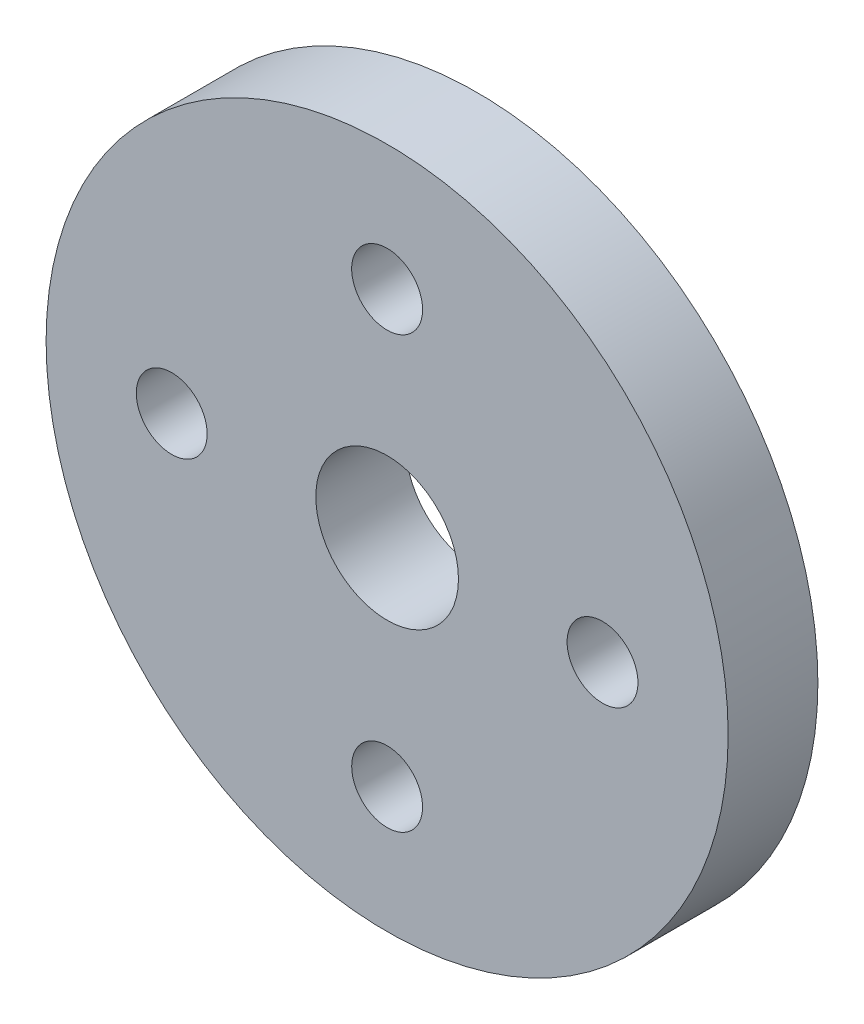
ISO-10303-21;
HEADER;
FILE_DESCRIPTION(('STEP AP214'),'2;1');
FILE_NAME('part.step','',(''),(''),'','','');
FILE_SCHEMA(('AUTOMOTIVE_DESIGN { 1 0 10303 214 1 1 1 1 }'));
ENDSEC;
DATA;
#1=APPLICATION_CONTEXT('core data for automotive mechanical design processes');
#2=APPLICATION_PROTOCOL_DEFINITION('international standard','automotive_design',2000,#1);
#3=PRODUCT_CONTEXT('',#1,'mechanical');
#4=PRODUCT('Part','Part','',(#3));
#5=PRODUCT_RELATED_PRODUCT_CATEGORY('part','',(#4));
#6=PRODUCT_DEFINITION_FORMATION('','',#4);
#7=PRODUCT_DEFINITION_CONTEXT('part definition',#1,'design');
#8=PRODUCT_DEFINITION('design','',#6,#7);
#9=PRODUCT_DEFINITION_SHAPE('','',#8);
#10=(LENGTH_UNIT() NAMED_UNIT(*) SI_UNIT(.MILLI.,.METRE.));
#11=(NAMED_UNIT(*) PLANE_ANGLE_UNIT() SI_UNIT($,.RADIAN.));
#12=(NAMED_UNIT(*) SI_UNIT($,.STERADIAN.) SOLID_ANGLE_UNIT());
#13=UNCERTAINTY_MEASURE_WITH_UNIT(LENGTH_MEASURE(1.E-05),#10,'distance_accuracy_value','');
#14=(GEOMETRIC_REPRESENTATION_CONTEXT(3) GLOBAL_UNCERTAINTY_ASSIGNED_CONTEXT((#13)) GLOBAL_UNIT_ASSIGNED_CONTEXT((#10,
#11,#12)) REPRESENTATION_CONTEXT('',''));
#15=CARTESIAN_POINT('',(0.,0.,0.));
#16=DIRECTION('',(0.,0.,1.));
#17=DIRECTION('',(1.,0.,0.));
#18=AXIS2_PLACEMENT_3D('',#15,#16,#17);
#19=CARTESIAN_POINT('',(0.,0.,5.));
#20=DIRECTION('',(0.,0.,1.));
#21=DIRECTION('',(1.,0.,0.));
#22=AXIS2_PLACEMENT_3D('',#19,#20,#21);
#23=PLANE('',#22);
#24=CARTESIAN_POINT('',(-12.,0.,5.));
#25=DIRECTION('',(0.,0.,1.));
#26=DIRECTION('',(-1.,0.,0.));
#27=AXIS2_PLACEMENT_3D('',#24,#25,#26);
#28=CIRCLE('',#27,1.975);
#29=CARTESIAN_POINT('',(-13.975,0.,5.));
#30=VERTEX_POINT('',#29);
#31=EDGE_CURVE('E58',#30,#30,#28,.T.);
#32=ORIENTED_EDGE('',*,*,#31,.F.);
#33=EDGE_LOOP('',(#32));
#34=FACE_BOUND('',#33,.T.);
#35=CARTESIAN_POINT('',(0.,-12.,5.));
#36=DIRECTION('',(0.,0.,1.));
#37=DIRECTION('',(-1.,0.,0.));
#38=AXIS2_PLACEMENT_3D('',#35,#36,#37);
#39=CIRCLE('',#38,1.975);
#40=CARTESIAN_POINT('',(-1.975,-12.,5.));
#41=VERTEX_POINT('',#40);
#42=EDGE_CURVE('E46',#41,#41,#39,.T.);
#43=ORIENTED_EDGE('',*,*,#42,.F.);
#44=EDGE_LOOP('',(#43));
#45=FACE_BOUND('',#44,.T.);
#46=CARTESIAN_POINT('',(0.,0.,5.));
#47=DIRECTION('',(0.,0.,1.));
#48=DIRECTION('',(1.,0.,0.));
#49=AXIS2_PLACEMENT_3D('',#46,#47,#48);
#50=CIRCLE('',#49,19.);
#51=CARTESIAN_POINT('',(19.,0.,5.));
#52=VERTEX_POINT('',#51);
#53=EDGE_CURVE('E10',#52,#52,#50,.T.);
#54=ORIENTED_EDGE('',*,*,#53,.T.);
#55=EDGE_LOOP('',(#54));
#56=FACE_BOUND('',#55,.T.);
#57=CARTESIAN_POINT('',(0.,12.,5.));
#58=DIRECTION('',(0.,0.,1.));
#59=DIRECTION('',(1.,0.,0.));
#60=AXIS2_PLACEMENT_3D('',#57,#58,#59);
#61=CIRCLE('',#60,1.975);
#62=CARTESIAN_POINT('',(1.975,12.,5.));
#63=VERTEX_POINT('',#62);
#64=EDGE_CURVE('E41',#63,#63,#61,.T.);
#65=ORIENTED_EDGE('',*,*,#64,.F.);
#66=EDGE_LOOP('',(#65));
#67=FACE_BOUND('',#66,.T.);
#68=CARTESIAN_POINT('',(12.,0.,5.));
#69=DIRECTION('',(0.,0.,1.));
#70=DIRECTION('',(1.,0.,0.));
#71=AXIS2_PLACEMENT_3D('',#68,#69,#70);
#72=CIRCLE('',#71,1.975);
#73=CARTESIAN_POINT('',(13.975,0.,5.));
#74=VERTEX_POINT('',#73);
#75=EDGE_CURVE('E52',#74,#74,#72,.T.);
#76=ORIENTED_EDGE('',*,*,#75,.F.);
#77=EDGE_LOOP('',(#76));
#78=FACE_BOUND('',#77,.T.);
#79=CARTESIAN_POINT('',(0.,0.,5.));
#80=DIRECTION('',(0.,0.,1.));
#81=DIRECTION('',(1.,0.,0.));
#82=AXIS2_PLACEMENT_3D('',#79,#80,#81);
#83=CIRCLE('',#82,3.975);
#84=CARTESIAN_POINT('',(3.975,0.,5.));
#85=VERTEX_POINT('',#84);
#86=EDGE_CURVE('E64',#85,#85,#83,.T.);
#87=ORIENTED_EDGE('',*,*,#86,.F.);
#88=EDGE_LOOP('',(#87));
#89=FACE_BOUND('',#88,.T.);
#90=ADVANCED_FACE('F30',(#34,#45,#56,#67,#78,#89),#23,.T.);
#91=CARTESIAN_POINT('',(0.,0.,0.));
#92=DIRECTION('',(0.,0.,1.));
#93=DIRECTION('',(1.,0.,0.));
#94=AXIS2_PLACEMENT_3D('',#91,#92,#93);
#95=PLANE('',#94);
#96=CARTESIAN_POINT('',(0.,0.,0.));
#97=DIRECTION('',(0.,0.,1.));
#98=DIRECTION('',(1.,0.,0.));
#99=AXIS2_PLACEMENT_3D('',#96,#97,#98);
#100=CIRCLE('',#99,19.);
#101=CARTESIAN_POINT('',(19.,0.,0.));
#102=VERTEX_POINT('',#101);
#103=EDGE_CURVE('E34',#102,#102,#100,.T.);
#104=ORIENTED_EDGE('',*,*,#103,.F.);
#105=EDGE_LOOP('',(#104));
#106=FACE_BOUND('',#105,.T.);
#107=CARTESIAN_POINT('',(0.,12.,0.));
#108=DIRECTION('',(0.,0.,1.));
#109=DIRECTION('',(1.,0.,0.));
#110=AXIS2_PLACEMENT_3D('',#107,#108,#109);
#111=CIRCLE('',#110,1.975);
#112=CARTESIAN_POINT('',(1.975,12.,0.));
#113=VERTEX_POINT('',#112);
#114=EDGE_CURVE('E43',#113,#113,#111,.T.);
#115=ORIENTED_EDGE('',*,*,#114,.T.);
#116=EDGE_LOOP('',(#115));
#117=FACE_BOUND('',#116,.T.);
#118=CARTESIAN_POINT('',(0.,-12.,0.));
#119=DIRECTION('',(0.,0.,1.));
#120=DIRECTION('',(-1.,0.,0.));
#121=AXIS2_PLACEMENT_3D('',#118,#119,#120);
#122=CIRCLE('',#121,1.975);
#123=CARTESIAN_POINT('',(-1.975,-12.,0.));
#124=VERTEX_POINT('',#123);
#125=EDGE_CURVE('E49',#124,#124,#122,.T.);
#126=ORIENTED_EDGE('',*,*,#125,.T.);
#127=EDGE_LOOP('',(#126));
#128=FACE_BOUND('',#127,.T.);
#129=CARTESIAN_POINT('',(12.,0.,0.));
#130=DIRECTION('',(0.,0.,1.));
#131=DIRECTION('',(1.,0.,0.));
#132=AXIS2_PLACEMENT_3D('',#129,#130,#131);
#133=CIRCLE('',#132,1.975);
#134=CARTESIAN_POINT('',(13.975,0.,0.));
#135=VERTEX_POINT('',#134);
#136=EDGE_CURVE('E55',#135,#135,#133,.T.);
#137=ORIENTED_EDGE('',*,*,#136,.T.);
#138=EDGE_LOOP('',(#137));
#139=FACE_BOUND('',#138,.T.);
#140=CARTESIAN_POINT('',(-12.,0.,0.));
#141=DIRECTION('',(0.,0.,1.));
#142=DIRECTION('',(-1.,0.,0.));
#143=AXIS2_PLACEMENT_3D('',#140,#141,#142);
#144=CIRCLE('',#143,1.975);
#145=CARTESIAN_POINT('',(-13.975,0.,0.));
#146=VERTEX_POINT('',#145);
#147=EDGE_CURVE('E61',#146,#146,#144,.T.);
#148=ORIENTED_EDGE('',*,*,#147,.T.);
#149=EDGE_LOOP('',(#148));
#150=FACE_BOUND('',#149,.T.);
#151=CARTESIAN_POINT('',(0.,0.,0.));
#152=DIRECTION('',(0.,0.,1.));
#153=DIRECTION('',(1.,0.,0.));
#154=AXIS2_PLACEMENT_3D('',#151,#152,#153);
#155=CIRCLE('',#154,3.975);
#156=CARTESIAN_POINT('',(3.975,0.,0.));
#157=VERTEX_POINT('',#156);
#158=EDGE_CURVE('E67',#157,#157,#155,.T.);
#159=ORIENTED_EDGE('',*,*,#158,.T.);
#160=EDGE_LOOP('',(#159));
#161=FACE_BOUND('',#160,.T.);
#162=ADVANCED_FACE('F77',(#106,#117,#128,#139,#150,#161),#95,.F.);
#163=CARTESIAN_POINT('',(0.,0.,5.));
#164=DIRECTION('',(0.,0.,-1.));
#165=DIRECTION('',(-1.,0.,0.));
#166=AXIS2_PLACEMENT_3D('',#163,#164,#165);
#167=CYLINDRICAL_SURFACE('',#166,19.);
#168=ORIENTED_EDGE('',*,*,#53,.F.);
#169=EDGE_LOOP('',(#168));
#170=FACE_BOUND('',#169,.T.);
#171=ORIENTED_EDGE('',*,*,#103,.T.);
#172=EDGE_LOOP('',(#171));
#173=FACE_BOUND('',#172,.T.);
#174=ADVANCED_FACE('F32',(#170,#173),#167,.T.);
#175=CARTESIAN_POINT('',(0.,12.,5.));
#176=DIRECTION('',(0.,0.,-1.));
#177=DIRECTION('',(-1.,0.,0.));
#178=AXIS2_PLACEMENT_3D('',#175,#176,#177);
#179=CYLINDRICAL_SURFACE('',#178,1.975);
#180=ORIENTED_EDGE('',*,*,#64,.T.);
#181=EDGE_LOOP('',(#180));
#182=FACE_BOUND('',#181,.T.);
#183=ORIENTED_EDGE('',*,*,#114,.F.);
#184=EDGE_LOOP('',(#183));
#185=FACE_BOUND('',#184,.T.);
#186=ADVANCED_FACE('F87',(#182,#185),#179,.F.);
#187=CARTESIAN_POINT('',(0.,-12.,5.));
#188=DIRECTION('',(0.,0.,-1.));
#189=DIRECTION('',(-1.,0.,0.));
#190=AXIS2_PLACEMENT_3D('',#187,#188,#189);
#191=CYLINDRICAL_SURFACE('',#190,1.975);
#192=ORIENTED_EDGE('',*,*,#42,.T.);
#193=EDGE_LOOP('',(#192));
#194=FACE_BOUND('',#193,.T.);
#195=ORIENTED_EDGE('',*,*,#125,.F.);
#196=EDGE_LOOP('',(#195));
#197=FACE_BOUND('',#196,.T.);
#198=ADVANCED_FACE('F90',(#194,#197),#191,.F.);
#199=CARTESIAN_POINT('',(12.,0.,5.));
#200=DIRECTION('',(0.,0.,-1.));
#201=DIRECTION('',(-1.,0.,0.));
#202=AXIS2_PLACEMENT_3D('',#199,#200,#201);
#203=CYLINDRICAL_SURFACE('',#202,1.975);
#204=ORIENTED_EDGE('',*,*,#75,.T.);
#205=EDGE_LOOP('',(#204));
#206=FACE_BOUND('',#205,.T.);
#207=ORIENTED_EDGE('',*,*,#136,.F.);
#208=EDGE_LOOP('',(#207));
#209=FACE_BOUND('',#208,.T.);
#210=ADVANCED_FACE('F94',(#206,#209),#203,.F.);
#211=CARTESIAN_POINT('',(-12.,0.,5.));
#212=DIRECTION('',(0.,0.,-1.));
#213=DIRECTION('',(-1.,0.,0.));
#214=AXIS2_PLACEMENT_3D('',#211,#212,#213);
#215=CYLINDRICAL_SURFACE('',#214,1.975);
#216=ORIENTED_EDGE('',*,*,#31,.T.);
#217=EDGE_LOOP('',(#216));
#218=FACE_BOUND('',#217,.T.);
#219=ORIENTED_EDGE('',*,*,#147,.F.);
#220=EDGE_LOOP('',(#219));
#221=FACE_BOUND('',#220,.T.);
#222=ADVANCED_FACE('F98',(#218,#221),#215,.F.);
#223=CARTESIAN_POINT('',(0.,0.,5.));
#224=DIRECTION('',(0.,0.,-1.));
#225=DIRECTION('',(-1.,0.,0.));
#226=AXIS2_PLACEMENT_3D('',#223,#224,#225);
#227=CYLINDRICAL_SURFACE('',#226,3.975);
#228=ORIENTED_EDGE('',*,*,#86,.T.);
#229=EDGE_LOOP('',(#228));
#230=FACE_BOUND('',#229,.T.);
#231=ORIENTED_EDGE('',*,*,#158,.F.);
#232=EDGE_LOOP('',(#231));
#233=FACE_BOUND('',#232,.T.);
#234=ADVANCED_FACE('F73',(#230,#233),#227,.F.);
#235=CLOSED_SHELL('',(#90,#162,#174,#186,#198,#210,#222,#234));
#236=MANIFOLD_SOLID_BREP('B2',#235);
#237=ADVANCED_BREP_SHAPE_REPRESENTATION('',(#18,#236),#14);
#238=SHAPE_DEFINITION_REPRESENTATION(#9,#237);
ENDSEC;
END-ISO-10303-21;
